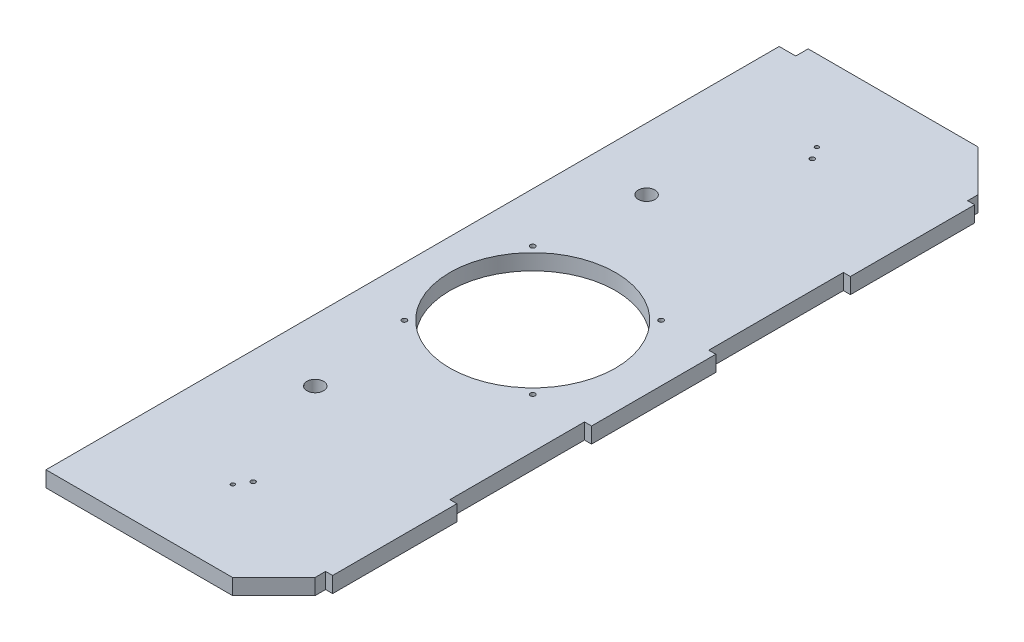
ISO-10303-21;
HEADER;
FILE_DESCRIPTION(('STEP AP214'),'2;1');
FILE_NAME('part.step','',(''),(''),'','','');
FILE_SCHEMA(('AUTOMOTIVE_DESIGN { 1 0 10303 214 1 1 1 1 }'));
ENDSEC;
DATA;
#1=APPLICATION_CONTEXT('core data for automotive mechanical design processes');
#2=APPLICATION_PROTOCOL_DEFINITION('international standard','automotive_design',2000,#1);
#3=PRODUCT_CONTEXT('',#1,'mechanical');
#4=PRODUCT('Part','Part','',(#3));
#5=PRODUCT_RELATED_PRODUCT_CATEGORY('part','',(#4));
#6=PRODUCT_DEFINITION_FORMATION('','',#4);
#7=PRODUCT_DEFINITION_CONTEXT('part definition',#1,'design');
#8=PRODUCT_DEFINITION('design','',#6,#7);
#9=PRODUCT_DEFINITION_SHAPE('','',#8);
#10=(LENGTH_UNIT() NAMED_UNIT(*) SI_UNIT(.MILLI.,.METRE.));
#11=(NAMED_UNIT(*) PLANE_ANGLE_UNIT() SI_UNIT($,.RADIAN.));
#12=(NAMED_UNIT(*) SI_UNIT($,.STERADIAN.) SOLID_ANGLE_UNIT());
#13=UNCERTAINTY_MEASURE_WITH_UNIT(LENGTH_MEASURE(1.E-05),#10,'distance_accuracy_value','');
#14=(GEOMETRIC_REPRESENTATION_CONTEXT(3) GLOBAL_UNCERTAINTY_ASSIGNED_CONTEXT((#13)) GLOBAL_UNIT_ASSIGNED_CONTEXT((#10,
#11,#12)) REPRESENTATION_CONTEXT('',''));
#15=CARTESIAN_POINT('',(0.,0.,0.));
#16=DIRECTION('',(0.,0.,1.));
#17=DIRECTION('',(1.,0.,0.));
#18=AXIS2_PLACEMENT_3D('',#15,#16,#17);
#19=CARTESIAN_POINT('',(0.,9.652,0.));
#20=DIRECTION('',(0.,-1.,0.));
#21=DIRECTION('',(0.,0.,-1.));
#22=AXIS2_PLACEMENT_3D('',#19,#20,#21);
#23=PLANE('',#22);
#24=CARTESIAN_POINT('',(65.024,9.652,-407.67));
#25=DIRECTION('',(0.,-1.,0.));
#26=DIRECTION('',(0.,0.,-1.));
#27=AXIS2_PLACEMENT_3D('',#24,#25,#26);
#28=CIRCLE('',#27,1.16786748412683);
#29=CARTESIAN_POINT('',(65.024,9.652,-408.837867484127));
#30=VERTEX_POINT('',#29);
#31=EDGE_CURVE('E446',#30,#30,#28,.T.);
#32=ORIENTED_EDGE('',*,*,#31,.T.);
#33=EDGE_LOOP('',(#32));
#34=FACE_BOUND('',#33,.T.);
#35=CARTESIAN_POINT('',(69.85,9.652,-400.05));
#36=DIRECTION('',(0.,-1.,0.));
#37=DIRECTION('',(0.,0.,-1.));
#38=AXIS2_PLACEMENT_3D('',#35,#36,#37);
#39=CIRCLE('',#38,1.41624735111162);
#40=CARTESIAN_POINT('',(69.85,9.652,-401.466247351112));
#41=VERTEX_POINT('',#40);
#42=EDGE_CURVE('E447',#41,#41,#39,.T.);
#43=ORIENTED_EDGE('',*,*,#42,.T.);
#44=EDGE_LOOP('',(#43));
#45=FACE_BOUND('',#44,.T.);
#46=CARTESIAN_POINT('',(65.024,9.652,-49.53));
#47=DIRECTION('',(0.,1.,0.));
#48=DIRECTION('',(0.,0.,1.));
#49=AXIS2_PLACEMENT_3D('',#46,#47,#48);
#50=CIRCLE('',#49,1.16786748412683);
#51=CARTESIAN_POINT('',(65.024,9.652,-48.3621325158732));
#52=VERTEX_POINT('',#51);
#53=EDGE_CURVE('E434',#52,#52,#50,.T.);
#54=ORIENTED_EDGE('',*,*,#53,.F.);
#55=EDGE_LOOP('',(#54));
#56=FACE_BOUND('',#55,.T.);
#57=CARTESIAN_POINT('',(69.85,9.652,-57.15));
#58=DIRECTION('',(0.,1.,0.));
#59=DIRECTION('',(0.,0.,1.));
#60=AXIS2_PLACEMENT_3D('',#57,#58,#59);
#61=CIRCLE('',#60,1.41624735111162);
#62=CARTESIAN_POINT('',(69.85,9.652,-55.7337526488884));
#63=VERTEX_POINT('',#62);
#64=EDGE_CURVE('E431',#63,#63,#61,.T.);
#65=ORIENTED_EDGE('',*,*,#64,.F.);
#66=EDGE_LOOP('',(#65));
#67=FACE_BOUND('',#66,.T.);
#68=DIRECTION('',(1.,0.,0.));
#69=VECTOR('',#68,1.);
#70=CARTESIAN_POINT('',(139.7,9.652,0.));
#71=LINE('',#70,#69);
#72=CARTESIAN_POINT('',(0.,9.652,0.));
#73=VERTEX_POINT('',#72);
#74=CARTESIAN_POINT('',(114.3,9.652,0.));
#75=VERTEX_POINT('',#74);
#76=EDGE_CURVE('E310',#73,#75,#71,.T.);
#77=ORIENTED_EDGE('',*,*,#76,.T.);
#78=DIRECTION('',(-0.707106781186549,0.,0.707106781186546));
#79=VECTOR('',#78,1.);
#80=CARTESIAN_POINT('',(139.7,9.652,-25.4));
#81=LINE('',#80,#79);
#82=CARTESIAN_POINT('',(139.7,9.652,-25.4));
#83=VERTEX_POINT('',#82);
#84=EDGE_CURVE('E48',#75,#83,#81,.F.);
#85=ORIENTED_EDGE('',*,*,#84,.T.);
#86=DIRECTION('',(0.,0.,-1.));
#87=VECTOR('',#86,1.);
#88=CARTESIAN_POINT('',(139.7,9.652,-457.2));
#89=LINE('',#88,#87);
#90=CARTESIAN_POINT('',(139.7,9.652,-31.75));
#91=VERTEX_POINT('',#90);
#92=EDGE_CURVE('E314',#83,#91,#89,.T.);
#93=ORIENTED_EDGE('',*,*,#92,.T.);
#94=DIRECTION('',(-1.,0.,0.));
#95=VECTOR('',#94,1.);
#96=CARTESIAN_POINT('',(144.018,9.652,-31.75));
#97=LINE('',#96,#95);
#98=CARTESIAN_POINT('',(144.018,9.652,-31.75));
#99=VERTEX_POINT('',#98);
#100=EDGE_CURVE('E257',#99,#91,#97,.T.);
#101=ORIENTED_EDGE('',*,*,#100,.F.);
#102=DIRECTION('',(0.,0.,1.));
#103=VECTOR('',#102,1.);
#104=CARTESIAN_POINT('',(144.018,9.652,-31.75));
#105=LINE('',#104,#103);
#106=CARTESIAN_POINT('',(144.018,9.652,-107.95));
#107=VERTEX_POINT('',#106);
#108=EDGE_CURVE('E255',#107,#99,#105,.T.);
#109=ORIENTED_EDGE('',*,*,#108,.F.);
#110=DIRECTION('',(-1.,0.,0.));
#111=VECTOR('',#110,1.);
#112=CARTESIAN_POINT('',(144.018,9.652,-107.95));
#113=LINE('',#112,#111);
#114=CARTESIAN_POINT('',(139.7,9.652,-107.95));
#115=VERTEX_POINT('',#114);
#116=EDGE_CURVE('E264',#107,#115,#113,.T.);
#117=ORIENTED_EDGE('',*,*,#116,.T.);
#118=CARTESIAN_POINT('',(139.7,9.652,-190.5));
#119=VERTEX_POINT('',#118);
#120=EDGE_CURVE('E318',#115,#119,#89,.T.);
#121=ORIENTED_EDGE('',*,*,#120,.T.);
#122=DIRECTION('',(-1.,0.,0.));
#123=VECTOR('',#122,1.);
#124=CARTESIAN_POINT('',(144.018,9.652,-190.5));
#125=LINE('',#124,#123);
#126=CARTESIAN_POINT('',(144.018,9.652,-190.5));
#127=VERTEX_POINT('',#126);
#128=EDGE_CURVE('E212',#127,#119,#125,.T.);
#129=ORIENTED_EDGE('',*,*,#128,.F.);
#130=DIRECTION('',(0.,0.,1.));
#131=VECTOR('',#130,1.);
#132=CARTESIAN_POINT('',(144.018,9.652,-190.5));
#133=LINE('',#132,#131);
#134=CARTESIAN_POINT('',(144.018,9.652,-266.7));
#135=VERTEX_POINT('',#134);
#136=EDGE_CURVE('E236',#135,#127,#133,.T.);
#137=ORIENTED_EDGE('',*,*,#136,.F.);
#138=DIRECTION('',(-1.,0.,0.));
#139=VECTOR('',#138,1.);
#140=CARTESIAN_POINT('',(144.018,9.652,-266.7));
#141=LINE('',#140,#139);
#142=CARTESIAN_POINT('',(139.7,9.652,-266.7));
#143=VERTEX_POINT('',#142);
#144=EDGE_CURVE('E228',#135,#143,#141,.T.);
#145=ORIENTED_EDGE('',*,*,#144,.T.);
#146=CARTESIAN_POINT('',(139.7,9.652,-349.25));
#147=VERTEX_POINT('',#146);
#148=EDGE_CURVE('E378',#143,#147,#89,.T.);
#149=ORIENTED_EDGE('',*,*,#148,.T.);
#150=DIRECTION('',(-1.,0.,0.));
#151=VECTOR('',#150,1.);
#152=CARTESIAN_POINT('',(144.018,9.652,-349.25));
#153=LINE('',#152,#151);
#154=CARTESIAN_POINT('',(144.018,9.652,-349.25));
#155=VERTEX_POINT('',#154);
#156=EDGE_CURVE('E207',#155,#147,#153,.T.);
#157=ORIENTED_EDGE('',*,*,#156,.F.);
#158=DIRECTION('',(0.,0.,1.));
#159=VECTOR('',#158,1.);
#160=CARTESIAN_POINT('',(144.018,9.652,-349.25));
#161=LINE('',#160,#159);
#162=CARTESIAN_POINT('',(144.018,9.652,-425.45));
#163=VERTEX_POINT('',#162);
#164=EDGE_CURVE('E198',#163,#155,#161,.T.);
#165=ORIENTED_EDGE('',*,*,#164,.F.);
#166=DIRECTION('',(-1.,0.,0.));
#167=VECTOR('',#166,1.);
#168=CARTESIAN_POINT('',(144.018,9.652,-425.45));
#169=LINE('',#168,#167);
#170=CARTESIAN_POINT('',(139.7,9.652,-425.45));
#171=VERTEX_POINT('',#170);
#172=EDGE_CURVE('E202',#163,#171,#169,.T.);
#173=ORIENTED_EDGE('',*,*,#172,.T.);
#174=CARTESIAN_POINT('',(139.7,9.652,-431.8));
#175=VERTEX_POINT('',#174);
#176=EDGE_CURVE('E55',#171,#175,#89,.T.);
#177=ORIENTED_EDGE('',*,*,#176,.T.);
#178=DIRECTION('',(0.707106781186546,0.,0.707106781186549));
#179=VECTOR('',#178,1.);
#180=CARTESIAN_POINT('',(114.3,9.652,-457.2));
#181=LINE('',#180,#179);
#182=CARTESIAN_POINT('',(114.3,9.652,-457.2));
#183=VERTEX_POINT('',#182);
#184=EDGE_CURVE('E341',#175,#183,#181,.F.);
#185=ORIENTED_EDGE('',*,*,#184,.T.);
#186=DIRECTION('',(-1.,0.,0.));
#187=VECTOR('',#186,1.);
#188=CARTESIAN_POINT('',(0.,9.652,-457.2));
#189=LINE('',#188,#187);
#190=CARTESIAN_POINT('',(10.16,9.652,-457.2));
#191=VERTEX_POINT('',#190);
#192=EDGE_CURVE('E317',#183,#191,#189,.T.);
#193=ORIENTED_EDGE('',*,*,#192,.T.);
#194=DIRECTION('',(0.,0.,-1.));
#195=VECTOR('',#194,1.);
#196=CARTESIAN_POINT('',(10.16,9.652,-457.2));
#197=LINE('',#196,#195);
#198=CARTESIAN_POINT('',(10.16,9.652,-449.58));
#199=VERTEX_POINT('',#198);
#200=EDGE_CURVE('E278',#199,#191,#197,.T.);
#201=ORIENTED_EDGE('',*,*,#200,.F.);
#202=DIRECTION('',(1.,0.,0.));
#203=VECTOR('',#202,1.);
#204=CARTESIAN_POINT('',(0.,9.652,-449.58));
#205=LINE('',#204,#203);
#206=CARTESIAN_POINT('',(0.,9.652,-449.58));
#207=VERTEX_POINT('',#206);
#208=EDGE_CURVE('E273',#207,#199,#205,.T.);
#209=ORIENTED_EDGE('',*,*,#208,.F.);
#210=DIRECTION('',(0.,0.,1.));
#211=VECTOR('',#210,1.);
#212=CARTESIAN_POINT('',(0.,9.652,0.));
#213=LINE('',#212,#211);
#214=EDGE_CURVE('E320',#207,#73,#213,.T.);
#215=ORIENTED_EDGE('',*,*,#214,.T.);
#216=EDGE_LOOP('',(#77,#85,#93,#101,#109,#117,#121,#129,#137,#145,#149,#157,#165,#173,#177,#185,
#193,#201,#209,#215));
#217=FACE_BOUND('',#216,.T.);
#218=CARTESIAN_POINT('',(69.85,9.652,-228.6));
#219=DIRECTION('',(0.,1.,0.));
#220=DIRECTION('',(0.,0.,1.));
#221=AXIS2_PLACEMENT_3D('',#218,#219,#220);
#222=CIRCLE('',#221,50.8);
#223=CARTESIAN_POINT('',(69.85,9.652,-177.8));
#224=VERTEX_POINT('',#223);
#225=EDGE_CURVE('E305',#224,#224,#222,.T.);
#226=ORIENTED_EDGE('',*,*,#225,.F.);
#227=EDGE_LOOP('',(#226));
#228=FACE_BOUND('',#227,.T.);
#229=CARTESIAN_POINT('',(38.1,9.652,-127.));
#230=DIRECTION('',(0.,1.,0.));
#231=DIRECTION('',(0.,0.,1.));
#232=AXIS2_PLACEMENT_3D('',#229,#230,#231);
#233=CIRCLE('',#232,5.08);
#234=CARTESIAN_POINT('',(38.1,9.652,-121.92));
#235=VERTEX_POINT('',#234);
#236=EDGE_CURVE('E299',#235,#235,#233,.T.);
#237=ORIENTED_EDGE('',*,*,#236,.F.);
#238=EDGE_LOOP('',(#237));
#239=FACE_BOUND('',#238,.T.);
#240=CARTESIAN_POINT('',(38.1,9.652,-330.2));
#241=DIRECTION('',(0.,1.,0.));
#242=DIRECTION('',(0.,0.,1.));
#243=AXIS2_PLACEMENT_3D('',#240,#241,#242);
#244=CIRCLE('',#243,5.08);
#245=CARTESIAN_POINT('',(38.1,9.652,-325.12));
#246=VERTEX_POINT('',#245);
#247=EDGE_CURVE('E293',#246,#246,#244,.T.);
#248=ORIENTED_EDGE('',*,*,#247,.F.);
#249=EDGE_LOOP('',(#248));
#250=FACE_BOUND('',#249,.T.);
#251=CARTESIAN_POINT('',(109.22,9.652,-267.97));
#252=DIRECTION('',(0.,1.,0.));
#253=DIRECTION('',(0.,0.,1.));
#254=AXIS2_PLACEMENT_3D('',#251,#252,#253);
#255=CIRCLE('',#254,1.5);
#256=CARTESIAN_POINT('',(109.22,9.652,-266.47));
#257=VERTEX_POINT('',#256);
#258=EDGE_CURVE('E407',#257,#257,#255,.T.);
#259=ORIENTED_EDGE('',*,*,#258,.F.);
#260=EDGE_LOOP('',(#259));
#261=FACE_BOUND('',#260,.T.);
#262=CARTESIAN_POINT('',(30.4800000000001,9.652,-267.97));
#263=DIRECTION('',(0.,1.,0.));
#264=DIRECTION('',(0.,0.,1.));
#265=AXIS2_PLACEMENT_3D('',#262,#263,#264);
#266=CIRCLE('',#265,1.5);
#267=CARTESIAN_POINT('',(30.4800000000001,9.652,-266.47));
#268=VERTEX_POINT('',#267);
#269=EDGE_CURVE('E415',#268,#268,#266,.T.);
#270=ORIENTED_EDGE('',*,*,#269,.F.);
#271=EDGE_LOOP('',(#270));
#272=FACE_BOUND('',#271,.T.);
#273=CARTESIAN_POINT('',(30.4800000000001,9.652,-189.23));
#274=DIRECTION('',(0.,1.,0.));
#275=DIRECTION('',(0.,0.,1.));
#276=AXIS2_PLACEMENT_3D('',#273,#274,#275);
#277=CIRCLE('',#276,1.5);
#278=CARTESIAN_POINT('',(30.4800000000001,9.652,-187.73));
#279=VERTEX_POINT('',#278);
#280=EDGE_CURVE('E421',#279,#279,#277,.T.);
#281=ORIENTED_EDGE('',*,*,#280,.F.);
#282=EDGE_LOOP('',(#281));
#283=FACE_BOUND('',#282,.T.);
#284=CARTESIAN_POINT('',(109.22,9.652,-189.23));
#285=DIRECTION('',(0.,1.,0.));
#286=DIRECTION('',(0.,0.,1.));
#287=AXIS2_PLACEMENT_3D('',#284,#285,#286);
#288=CIRCLE('',#287,1.5);
#289=CARTESIAN_POINT('',(109.22,9.652,-187.73));
#290=VERTEX_POINT('',#289);
#291=EDGE_CURVE('E427',#290,#290,#288,.T.);
#292=ORIENTED_EDGE('',*,*,#291,.F.);
#293=EDGE_LOOP('',(#292));
#294=FACE_BOUND('',#293,.T.);
#295=ADVANCED_FACE('F39',(#34,#45,#56,#67,#217,#228,#239,#250,#261,#272,#283,#294),#23,.F.);
#296=CARTESIAN_POINT('',(139.7,9.652,-457.2));
#297=DIRECTION('',(-1.,0.,0.));
#298=DIRECTION('',(0.,0.,1.));
#299=AXIS2_PLACEMENT_3D('',#296,#297,#298);
#300=PLANE('',#299);
#301=DIRECTION('',(0.,-1.,0.));
#302=VECTOR('',#301,1.);
#303=CARTESIAN_POINT('',(139.7,9.652,-349.25));
#304=LINE('',#303,#302);
#305=CARTESIAN_POINT('',(139.7,0.,-349.25));
#306=VERTEX_POINT('',#305);
#307=EDGE_CURVE('E63',#147,#306,#304,.T.);
#308=ORIENTED_EDGE('',*,*,#307,.F.);
#309=ORIENTED_EDGE('',*,*,#148,.F.);
#310=DIRECTION('',(0.,1.,0.));
#311=VECTOR('',#310,1.);
#312=CARTESIAN_POINT('',(139.7,9.652,-266.7));
#313=LINE('',#312,#311);
#314=CARTESIAN_POINT('',(139.7,0.,-266.7));
#315=VERTEX_POINT('',#314);
#316=EDGE_CURVE('E232',#315,#143,#313,.T.);
#317=ORIENTED_EDGE('',*,*,#316,.F.);
#318=DIRECTION('',(0.,0.,-1.));
#319=VECTOR('',#318,1.);
#320=CARTESIAN_POINT('',(139.7,0.,-457.2));
#321=LINE('',#320,#319);
#322=EDGE_CURVE('E189',#315,#306,#321,.T.);
#323=ORIENTED_EDGE('',*,*,#322,.T.);
#324=EDGE_LOOP('',(#308,#309,#317,#323));
#325=FACE_BOUND('',#324,.T.);
#326=ADVANCED_FACE('F399',(#325),#300,.F.);
#327=DIRECTION('',(0.,1.,0.));
#328=VECTOR('',#327,1.);
#329=CARTESIAN_POINT('',(139.7,9.652,-425.45));
#330=LINE('',#329,#328);
#331=CARTESIAN_POINT('',(139.7,0.,-425.45));
#332=VERTEX_POINT('',#331);
#333=EDGE_CURVE('E193',#332,#171,#330,.T.);
#334=ORIENTED_EDGE('',*,*,#333,.F.);
#335=CARTESIAN_POINT('',(139.7,0.,-431.8));
#336=VERTEX_POINT('',#335);
#337=EDGE_CURVE('E178',#332,#336,#321,.T.);
#338=ORIENTED_EDGE('',*,*,#337,.T.);
#339=DIRECTION('',(0.,1.,0.));
#340=VECTOR('',#339,1.);
#341=CARTESIAN_POINT('',(139.7,9.652,-431.8));
#342=LINE('',#341,#340);
#343=EDGE_CURVE('E331',#336,#175,#342,.T.);
#344=ORIENTED_EDGE('',*,*,#343,.T.);
#345=ORIENTED_EDGE('',*,*,#176,.F.);
#346=EDGE_LOOP('',(#334,#338,#344,#345));
#347=FACE_BOUND('',#346,.T.);
#348=ADVANCED_FACE('F194',(#347),#300,.F.);
#349=DIRECTION('',(0.,-1.,0.));
#350=VECTOR('',#349,1.);
#351=CARTESIAN_POINT('',(139.7,9.652,-190.5));
#352=LINE('',#351,#350);
#353=CARTESIAN_POINT('',(139.7,0.,-190.5));
#354=VERTEX_POINT('',#353);
#355=EDGE_CURVE('E235',#119,#354,#352,.T.);
#356=ORIENTED_EDGE('',*,*,#355,.F.);
#357=ORIENTED_EDGE('',*,*,#120,.F.);
#358=DIRECTION('',(0.,1.,0.));
#359=VECTOR('',#358,1.);
#360=CARTESIAN_POINT('',(139.7,9.652,-107.95));
#361=LINE('',#360,#359);
#362=CARTESIAN_POINT('',(139.7,0.,-107.95));
#363=VERTEX_POINT('',#362);
#364=EDGE_CURVE('E251',#363,#115,#361,.T.);
#365=ORIENTED_EDGE('',*,*,#364,.F.);
#366=EDGE_CURVE('E326',#363,#354,#321,.T.);
#367=ORIENTED_EDGE('',*,*,#366,.T.);
#368=EDGE_LOOP('',(#356,#357,#365,#367));
#369=FACE_BOUND('',#368,.T.);
#370=ADVANCED_FACE('F510',(#369),#300,.F.);
#371=DIRECTION('',(0.,-1.,0.));
#372=VECTOR('',#371,1.);
#373=CARTESIAN_POINT('',(139.7,9.652,-31.75));
#374=LINE('',#373,#372);
#375=CARTESIAN_POINT('',(139.7,0.,-31.75));
#376=VERTEX_POINT('',#375);
#377=EDGE_CURVE('E239',#91,#376,#374,.T.);
#378=ORIENTED_EDGE('',*,*,#377,.F.);
#379=ORIENTED_EDGE('',*,*,#92,.F.);
#380=DIRECTION('',(0.,-1.,0.));
#381=VECTOR('',#380,1.);
#382=CARTESIAN_POINT('',(139.7,9.652,-25.4));
#383=LINE('',#382,#381);
#384=CARTESIAN_POINT('',(139.7,0.,-25.4));
#385=VERTEX_POINT('',#384);
#386=EDGE_CURVE('E333',#83,#385,#383,.T.);
#387=ORIENTED_EDGE('',*,*,#386,.T.);
#388=EDGE_CURVE('E192',#385,#376,#321,.T.);
#389=ORIENTED_EDGE('',*,*,#388,.T.);
#390=EDGE_LOOP('',(#378,#379,#387,#389));
#391=FACE_BOUND('',#390,.T.);
#392=ADVANCED_FACE('F352',(#391),#300,.F.);
#393=CARTESIAN_POINT('',(0.,0.,0.));
#394=DIRECTION('',(0.,-1.,0.));
#395=DIRECTION('',(0.,0.,-1.));
#396=AXIS2_PLACEMENT_3D('',#393,#394,#395);
#397=PLANE('',#396);
#398=CARTESIAN_POINT('',(65.024,0.,-407.67));
#399=DIRECTION('',(0.,-1.,0.));
#400=DIRECTION('',(0.,0.,-1.));
#401=AXIS2_PLACEMENT_3D('',#398,#399,#400);
#402=CIRCLE('',#401,1.16786748412683);
#403=CARTESIAN_POINT('',(65.024,0.,-408.837867484127));
#404=VERTEX_POINT('',#403);
#405=EDGE_CURVE('E438',#404,#404,#402,.T.);
#406=ORIENTED_EDGE('',*,*,#405,.F.);
#407=EDGE_LOOP('',(#406));
#408=FACE_BOUND('',#407,.T.);
#409=CARTESIAN_POINT('',(69.85,0.,-400.05));
#410=DIRECTION('',(0.,-1.,0.));
#411=DIRECTION('',(0.,0.,-1.));
#412=AXIS2_PLACEMENT_3D('',#409,#410,#411);
#413=CIRCLE('',#412,1.41624735111162);
#414=CARTESIAN_POINT('',(69.85,0.,-401.466247351112));
#415=VERTEX_POINT('',#414);
#416=EDGE_CURVE('E443',#415,#415,#413,.T.);
#417=ORIENTED_EDGE('',*,*,#416,.F.);
#418=EDGE_LOOP('',(#417));
#419=FACE_BOUND('',#418,.T.);
#420=CARTESIAN_POINT('',(65.024,0.,-49.53));
#421=DIRECTION('',(0.,-1.,0.));
#422=DIRECTION('',(0.,0.,-1.));
#423=AXIS2_PLACEMENT_3D('',#420,#421,#422);
#424=CIRCLE('',#423,1.16786748412683);
#425=CARTESIAN_POINT('',(65.024,0.,-50.6978674841269));
#426=VERTEX_POINT('',#425);
#427=EDGE_CURVE('E430',#426,#426,#424,.F.);
#428=ORIENTED_EDGE('',*,*,#427,.T.);
#429=EDGE_LOOP('',(#428));
#430=FACE_BOUND('',#429,.T.);
#431=CARTESIAN_POINT('',(69.85,0.,-57.15));
#432=DIRECTION('',(0.,-1.,0.));
#433=DIRECTION('',(0.,0.,-1.));
#434=AXIS2_PLACEMENT_3D('',#431,#432,#433);
#435=CIRCLE('',#434,1.41624735111162);
#436=CARTESIAN_POINT('',(69.85,0.,-58.5662473511116));
#437=VERTEX_POINT('',#436);
#438=EDGE_CURVE('E435',#437,#437,#435,.F.);
#439=ORIENTED_EDGE('',*,*,#438,.T.);
#440=EDGE_LOOP('',(#439));
#441=FACE_BOUND('',#440,.T.);
#442=CARTESIAN_POINT('',(109.22,0.,-189.23));
#443=DIRECTION('',(0.,-1.,0.));
#444=DIRECTION('',(0.,0.,-1.));
#445=AXIS2_PLACEMENT_3D('',#442,#443,#444);
#446=CIRCLE('',#445,1.5);
#447=CARTESIAN_POINT('',(109.22,0.,-190.73));
#448=VERTEX_POINT('',#447);
#449=EDGE_CURVE('E424',#448,#448,#446,.T.);
#450=ORIENTED_EDGE('',*,*,#449,.F.);
#451=EDGE_LOOP('',(#450));
#452=FACE_BOUND('',#451,.T.);
#453=CARTESIAN_POINT('',(30.4800000000001,0.,-189.23));
#454=DIRECTION('',(0.,-1.,0.));
#455=DIRECTION('',(0.,0.,-1.));
#456=AXIS2_PLACEMENT_3D('',#453,#454,#455);
#457=CIRCLE('',#456,1.5);
#458=CARTESIAN_POINT('',(30.4800000000001,0.,-190.73));
#459=VERTEX_POINT('',#458);
#460=EDGE_CURVE('E418',#459,#459,#457,.T.);
#461=ORIENTED_EDGE('',*,*,#460,.F.);
#462=EDGE_LOOP('',(#461));
#463=FACE_BOUND('',#462,.T.);
#464=CARTESIAN_POINT('',(30.4800000000001,0.,-267.97));
#465=DIRECTION('',(0.,-1.,0.));
#466=DIRECTION('',(0.,0.,-1.));
#467=AXIS2_PLACEMENT_3D('',#464,#465,#466);
#468=CIRCLE('',#467,1.5);
#469=CARTESIAN_POINT('',(30.4800000000001,0.,-269.47));
#470=VERTEX_POINT('',#469);
#471=EDGE_CURVE('E412',#470,#470,#468,.T.);
#472=ORIENTED_EDGE('',*,*,#471,.F.);
#473=EDGE_LOOP('',(#472));
#474=FACE_BOUND('',#473,.T.);
#475=CARTESIAN_POINT('',(109.22,0.,-267.97));
#476=DIRECTION('',(0.,-1.,0.));
#477=DIRECTION('',(0.,0.,-1.));
#478=AXIS2_PLACEMENT_3D('',#475,#476,#477);
#479=CIRCLE('',#478,1.5);
#480=CARTESIAN_POINT('',(109.22,0.,-269.47));
#481=VERTEX_POINT('',#480);
#482=EDGE_CURVE('E405',#481,#481,#479,.T.);
#483=ORIENTED_EDGE('',*,*,#482,.F.);
#484=EDGE_LOOP('',(#483));
#485=FACE_BOUND('',#484,.T.);
#486=ORIENTED_EDGE('',*,*,#388,.F.);
#487=DIRECTION('',(0.707106781186549,0.,-0.707106781186546));
#488=VECTOR('',#487,1.);
#489=CARTESIAN_POINT('',(57.1499999999997,0.,57.15));
#490=LINE('',#489,#488);
#491=CARTESIAN_POINT('',(114.3,0.,0.));
#492=VERTEX_POINT('',#491);
#493=EDGE_CURVE('E337',#385,#492,#490,.F.);
#494=ORIENTED_EDGE('',*,*,#493,.T.);
#495=DIRECTION('',(1.,0.,0.));
#496=VECTOR('',#495,1.);
#497=CARTESIAN_POINT('',(139.7,0.,0.));
#498=LINE('',#497,#496);
#499=CARTESIAN_POINT('',(0.,0.,0.));
#500=VERTEX_POINT('',#499);
#501=EDGE_CURVE('E190',#500,#492,#498,.T.);
#502=ORIENTED_EDGE('',*,*,#501,.F.);
#503=DIRECTION('',(0.,0.,1.));
#504=VECTOR('',#503,1.);
#505=CARTESIAN_POINT('',(0.,0.,0.));
#506=LINE('',#505,#504);
#507=CARTESIAN_POINT('',(0.,0.,-449.58));
#508=VERTEX_POINT('',#507);
#509=EDGE_CURVE('E313',#508,#500,#506,.T.);
#510=ORIENTED_EDGE('',*,*,#509,.F.);
#511=DIRECTION('',(1.,0.,0.));
#512=VECTOR('',#511,1.);
#513=CARTESIAN_POINT('',(0.,0.,-449.58));
#514=LINE('',#513,#512);
#515=CARTESIAN_POINT('',(10.16,0.,-449.58));
#516=VERTEX_POINT('',#515);
#517=EDGE_CURVE('E274',#508,#516,#514,.T.);
#518=ORIENTED_EDGE('',*,*,#517,.T.);
#519=DIRECTION('',(0.,0.,-1.));
#520=VECTOR('',#519,1.);
#521=CARTESIAN_POINT('',(10.16,0.,-457.2));
#522=LINE('',#521,#520);
#523=CARTESIAN_POINT('',(10.16,0.,-457.2));
#524=VERTEX_POINT('',#523);
#525=EDGE_CURVE('E277',#516,#524,#522,.T.);
#526=ORIENTED_EDGE('',*,*,#525,.T.);
#527=DIRECTION('',(-1.,0.,0.));
#528=VECTOR('',#527,1.);
#529=CARTESIAN_POINT('',(0.,0.,-457.2));
#530=LINE('',#529,#528);
#531=CARTESIAN_POINT('',(114.3,0.,-457.2));
#532=VERTEX_POINT('',#531);
#533=EDGE_CURVE('E325',#532,#524,#530,.T.);
#534=ORIENTED_EDGE('',*,*,#533,.F.);
#535=DIRECTION('',(-0.707106781186546,0.,-0.707106781186549));
#536=VECTOR('',#535,1.);
#537=CARTESIAN_POINT('',(285.75,0.,-285.749999999999));
#538=LINE('',#537,#536);
#539=EDGE_CURVE('E187',#532,#336,#538,.F.);
#540=ORIENTED_EDGE('',*,*,#539,.T.);
#541=ORIENTED_EDGE('',*,*,#337,.F.);
#542=DIRECTION('',(-1.,0.,0.));
#543=VECTOR('',#542,1.);
#544=CARTESIAN_POINT('',(144.018,0.,-425.45));
#545=LINE('',#544,#543);
#546=CARTESIAN_POINT('',(144.018,0.,-425.45));
#547=VERTEX_POINT('',#546);
#548=EDGE_CURVE('E184',#547,#332,#545,.T.);
#549=ORIENTED_EDGE('',*,*,#548,.F.);
#550=DIRECTION('',(0.,0.,-1.));
#551=VECTOR('',#550,1.);
#552=CARTESIAN_POINT('',(144.018,0.,-349.25));
#553=LINE('',#552,#551);
#554=CARTESIAN_POINT('',(144.018,0.,-349.25));
#555=VERTEX_POINT('',#554);
#556=EDGE_CURVE('E214',#555,#547,#553,.T.);
#557=ORIENTED_EDGE('',*,*,#556,.F.);
#558=DIRECTION('',(-1.,0.,0.));
#559=VECTOR('',#558,1.);
#560=CARTESIAN_POINT('',(144.018,0.,-349.25));
#561=LINE('',#560,#559);
#562=EDGE_CURVE('E203',#555,#306,#561,.T.);
#563=ORIENTED_EDGE('',*,*,#562,.T.);
#564=ORIENTED_EDGE('',*,*,#322,.F.);
#565=DIRECTION('',(-1.,0.,0.));
#566=VECTOR('',#565,1.);
#567=CARTESIAN_POINT('',(144.018,0.,-266.7));
#568=LINE('',#567,#566);
#569=CARTESIAN_POINT('',(144.018,0.,-266.7));
#570=VERTEX_POINT('',#569);
#571=EDGE_CURVE('E225',#570,#315,#568,.T.);
#572=ORIENTED_EDGE('',*,*,#571,.F.);
#573=DIRECTION('',(0.,0.,-1.));
#574=VECTOR('',#573,1.);
#575=CARTESIAN_POINT('',(144.018,0.,-190.5));
#576=LINE('',#575,#574);
#577=CARTESIAN_POINT('',(144.018,0.,-190.5));
#578=VERTEX_POINT('',#577);
#579=EDGE_CURVE('E241',#578,#570,#576,.T.);
#580=ORIENTED_EDGE('',*,*,#579,.F.);
#581=DIRECTION('',(-1.,0.,0.));
#582=VECTOR('',#581,1.);
#583=CARTESIAN_POINT('',(144.018,0.,-190.5));
#584=LINE('',#583,#582);
#585=EDGE_CURVE('E222',#578,#354,#584,.T.);
#586=ORIENTED_EDGE('',*,*,#585,.T.);
#587=ORIENTED_EDGE('',*,*,#366,.F.);
#588=DIRECTION('',(-1.,0.,0.));
#589=VECTOR('',#588,1.);
#590=CARTESIAN_POINT('',(144.018,0.,-107.95));
#591=LINE('',#590,#589);
#592=CARTESIAN_POINT('',(144.018,0.,-107.95));
#593=VERTEX_POINT('',#592);
#594=EDGE_CURVE('E267',#593,#363,#591,.T.);
#595=ORIENTED_EDGE('',*,*,#594,.F.);
#596=DIRECTION('',(0.,0.,-1.));
#597=VECTOR('',#596,1.);
#598=CARTESIAN_POINT('',(144.018,0.,-31.75));
#599=LINE('',#598,#597);
#600=CARTESIAN_POINT('',(144.018,0.,-31.75));
#601=VERTEX_POINT('',#600);
#602=EDGE_CURVE('E250',#601,#593,#599,.T.);
#603=ORIENTED_EDGE('',*,*,#602,.F.);
#604=DIRECTION('',(-1.,0.,0.));
#605=VECTOR('',#604,1.);
#606=CARTESIAN_POINT('',(144.018,0.,-31.75));
#607=LINE('',#606,#605);
#608=EDGE_CURVE('E270',#601,#376,#607,.T.);
#609=ORIENTED_EDGE('',*,*,#608,.T.);
#610=EDGE_LOOP('',(#486,#494,#502,#510,#518,#526,#534,#540,#541,#549,#557,#563,#564,#572,#580,
#586,#587,#595,#603,#609));
#611=FACE_BOUND('',#610,.T.);
#612=CARTESIAN_POINT('',(38.1,0.,-127.));
#613=DIRECTION('',(0.,1.,0.));
#614=DIRECTION('',(0.,0.,1.));
#615=AXIS2_PLACEMENT_3D('',#612,#613,#614);
#616=CIRCLE('',#615,5.08);
#617=CARTESIAN_POINT('',(38.1,0.,-121.92));
#618=VERTEX_POINT('',#617);
#619=EDGE_CURVE('E296',#618,#618,#616,.T.);
#620=ORIENTED_EDGE('',*,*,#619,.T.);
#621=EDGE_LOOP('',(#620));
#622=FACE_BOUND('',#621,.T.);
#623=CARTESIAN_POINT('',(69.85,0.,-228.6));
#624=DIRECTION('',(0.,1.,0.));
#625=DIRECTION('',(0.,0.,1.));
#626=AXIS2_PLACEMENT_3D('',#623,#624,#625);
#627=CIRCLE('',#626,50.8);
#628=CARTESIAN_POINT('',(69.85,0.,-177.8));
#629=VERTEX_POINT('',#628);
#630=EDGE_CURVE('E302',#629,#629,#627,.T.);
#631=ORIENTED_EDGE('',*,*,#630,.T.);
#632=EDGE_LOOP('',(#631));
#633=FACE_BOUND('',#632,.T.);
#634=CARTESIAN_POINT('',(38.1,0.,-330.2));
#635=DIRECTION('',(0.,1.,0.));
#636=DIRECTION('',(0.,0.,1.));
#637=AXIS2_PLACEMENT_3D('',#634,#635,#636);
#638=CIRCLE('',#637,5.08);
#639=CARTESIAN_POINT('',(38.1,0.,-325.12));
#640=VERTEX_POINT('',#639);
#641=EDGE_CURVE('E289',#640,#640,#638,.T.);
#642=ORIENTED_EDGE('',*,*,#641,.T.);
#643=EDGE_LOOP('',(#642));
#644=FACE_BOUND('',#643,.T.);
#645=ADVANCED_FACE('F180',(#408,#419,#430,#441,#452,#463,#474,#485,#611,#622,#633,#644),#397,.T.);
#646=CARTESIAN_POINT('',(139.7,9.652,0.));
#647=DIRECTION('',(0.,0.,-1.));
#648=DIRECTION('',(-1.,0.,0.));
#649=AXIS2_PLACEMENT_3D('',#646,#647,#648);
#650=PLANE('',#649);
#651=ORIENTED_EDGE('',*,*,#501,.T.);
#652=DIRECTION('',(0.,1.,0.));
#653=VECTOR('',#652,1.);
#654=CARTESIAN_POINT('',(114.3,9.652,0.));
#655=LINE('',#654,#653);
#656=EDGE_CURVE('E339',#492,#75,#655,.T.);
#657=ORIENTED_EDGE('',*,*,#656,.T.);
#658=ORIENTED_EDGE('',*,*,#76,.F.);
#659=DIRECTION('',(0.,-1.,0.));
#660=VECTOR('',#659,1.);
#661=CARTESIAN_POINT('',(0.,9.652,0.));
#662=LINE('',#661,#660);
#663=EDGE_CURVE('E322',#73,#500,#662,.T.);
#664=ORIENTED_EDGE('',*,*,#663,.T.);
#665=EDGE_LOOP('',(#651,#657,#658,#664));
#666=FACE_BOUND('',#665,.T.);
#667=ADVANCED_FACE('F357',(#666),#650,.F.);
#668=CARTESIAN_POINT('',(0.,9.652,-457.2));
#669=DIRECTION('',(0.,0.,1.));
#670=DIRECTION('',(1.,0.,0.));
#671=AXIS2_PLACEMENT_3D('',#668,#669,#670);
#672=PLANE('',#671);
#673=ORIENTED_EDGE('',*,*,#192,.F.);
#674=DIRECTION('',(0.,-1.,0.));
#675=VECTOR('',#674,1.);
#676=CARTESIAN_POINT('',(114.3,9.652,-457.2));
#677=LINE('',#676,#675);
#678=EDGE_CURVE('E11',#183,#532,#677,.T.);
#679=ORIENTED_EDGE('',*,*,#678,.T.);
#680=ORIENTED_EDGE('',*,*,#533,.T.);
#681=DIRECTION('',(0.,1.,0.));
#682=VECTOR('',#681,1.);
#683=CARTESIAN_POINT('',(10.16,0.,-457.2));
#684=LINE('',#683,#682);
#685=EDGE_CURVE('E286',#524,#191,#684,.T.);
#686=ORIENTED_EDGE('',*,*,#685,.T.);
#687=EDGE_LOOP('',(#673,#679,#680,#686));
#688=FACE_BOUND('',#687,.T.);
#689=ADVANCED_FACE('F373',(#688),#672,.F.);
#690=CARTESIAN_POINT('',(0.,9.652,0.));
#691=DIRECTION('',(1.,0.,0.));
#692=DIRECTION('',(0.,0.,-1.));
#693=AXIS2_PLACEMENT_3D('',#690,#691,#692);
#694=PLANE('',#693);
#695=ORIENTED_EDGE('',*,*,#214,.F.);
#696=DIRECTION('',(0.,1.,0.));
#697=VECTOR('',#696,1.);
#698=CARTESIAN_POINT('',(0.,0.,-449.58));
#699=LINE('',#698,#697);
#700=EDGE_CURVE('E281',#508,#207,#699,.T.);
#701=ORIENTED_EDGE('',*,*,#700,.F.);
#702=ORIENTED_EDGE('',*,*,#509,.T.);
#703=ORIENTED_EDGE('',*,*,#663,.F.);
#704=EDGE_LOOP('',(#695,#701,#702,#703));
#705=FACE_BOUND('',#704,.T.);
#706=ADVANCED_FACE('F361',(#705),#694,.F.);
#707=CARTESIAN_POINT('',(69.85,9.652,-228.6));
#708=DIRECTION('',(0.,-1.,0.));
#709=DIRECTION('',(0.,0.,-1.));
#710=AXIS2_PLACEMENT_3D('',#707,#708,#709);
#711=CYLINDRICAL_SURFACE('',#710,50.8);
#712=ORIENTED_EDGE('',*,*,#225,.T.);
#713=EDGE_LOOP('',(#712));
#714=FACE_BOUND('',#713,.T.);
#715=ORIENTED_EDGE('',*,*,#630,.F.);
#716=EDGE_LOOP('',(#715));
#717=FACE_BOUND('',#716,.T.);
#718=ADVANCED_FACE('F502',(#714,#717),#711,.F.);
#719=CARTESIAN_POINT('',(38.1,9.652,-127.));
#720=DIRECTION('',(0.,-1.,0.));
#721=DIRECTION('',(0.,0.,-1.));
#722=AXIS2_PLACEMENT_3D('',#719,#720,#721);
#723=CYLINDRICAL_SURFACE('',#722,5.08);
#724=ORIENTED_EDGE('',*,*,#236,.T.);
#725=EDGE_LOOP('',(#724));
#726=FACE_BOUND('',#725,.T.);
#727=ORIENTED_EDGE('',*,*,#619,.F.);
#728=EDGE_LOOP('',(#727));
#729=FACE_BOUND('',#728,.T.);
#730=ADVANCED_FACE('F530',(#726,#729),#723,.F.);
#731=CARTESIAN_POINT('',(38.1,9.652,-330.2));
#732=DIRECTION('',(0.,-1.,0.));
#733=DIRECTION('',(0.,0.,-1.));
#734=AXIS2_PLACEMENT_3D('',#731,#732,#733);
#735=CYLINDRICAL_SURFACE('',#734,5.08);
#736=ORIENTED_EDGE('',*,*,#247,.T.);
#737=EDGE_LOOP('',(#736));
#738=FACE_BOUND('',#737,.T.);
#739=ORIENTED_EDGE('',*,*,#641,.F.);
#740=EDGE_LOOP('',(#739));
#741=FACE_BOUND('',#740,.T.);
#742=ADVANCED_FACE('F525',(#738,#741),#735,.F.);
#743=CARTESIAN_POINT('',(10.16,0.,-457.2));
#744=DIRECTION('',(1.,0.,0.));
#745=DIRECTION('',(0.,0.,-1.));
#746=AXIS2_PLACEMENT_3D('',#743,#744,#745);
#747=PLANE('',#746);
#748=ORIENTED_EDGE('',*,*,#200,.T.);
#749=ORIENTED_EDGE('',*,*,#685,.F.);
#750=ORIENTED_EDGE('',*,*,#525,.F.);
#751=DIRECTION('',(0.,1.,0.));
#752=VECTOR('',#751,1.);
#753=CARTESIAN_POINT('',(10.16,0.,-449.58));
#754=LINE('',#753,#752);
#755=EDGE_CURVE('E290',#516,#199,#754,.T.);
#756=ORIENTED_EDGE('',*,*,#755,.T.);
#757=EDGE_LOOP('',(#748,#749,#750,#756));
#758=FACE_BOUND('',#757,.T.);
#759=ADVANCED_FACE('F370',(#758),#747,.F.);
#760=CARTESIAN_POINT('',(0.,0.,-449.58));
#761=DIRECTION('',(0.,0.,1.));
#762=DIRECTION('',(1.,0.,0.));
#763=AXIS2_PLACEMENT_3D('',#760,#761,#762);
#764=PLANE('',#763);
#765=ORIENTED_EDGE('',*,*,#208,.T.);
#766=ORIENTED_EDGE('',*,*,#755,.F.);
#767=ORIENTED_EDGE('',*,*,#517,.F.);
#768=ORIENTED_EDGE('',*,*,#700,.T.);
#769=EDGE_LOOP('',(#765,#766,#767,#768));
#770=FACE_BOUND('',#769,.T.);
#771=ADVANCED_FACE('F365',(#770),#764,.F.);
#772=CARTESIAN_POINT('',(139.7,9.652,-25.4));
#773=DIRECTION('',(-0.707106781186546,0.,-0.707106781186549));
#774=DIRECTION('',(0.,-1.,0.));
#775=AXIS2_PLACEMENT_3D('',#772,#773,#774);
#776=PLANE('',#775);
#777=ORIENTED_EDGE('',*,*,#84,.F.);
#778=ORIENTED_EDGE('',*,*,#656,.F.);
#779=ORIENTED_EDGE('',*,*,#493,.F.);
#780=ORIENTED_EDGE('',*,*,#386,.F.);
#781=EDGE_LOOP('',(#777,#778,#779,#780));
#782=FACE_BOUND('',#781,.T.);
#783=ADVANCED_FACE('F353',(#782),#776,.F.);
#784=CARTESIAN_POINT('',(114.3,9.652,-457.2));
#785=DIRECTION('',(-0.707106781186549,0.,0.707106781186546));
#786=DIRECTION('',(0.,-1.,0.));
#787=AXIS2_PLACEMENT_3D('',#784,#785,#786);
#788=PLANE('',#787);
#789=ORIENTED_EDGE('',*,*,#184,.F.);
#790=ORIENTED_EDGE('',*,*,#343,.F.);
#791=ORIENTED_EDGE('',*,*,#539,.F.);
#792=ORIENTED_EDGE('',*,*,#678,.F.);
#793=EDGE_LOOP('',(#789,#790,#791,#792));
#794=FACE_BOUND('',#793,.T.);
#795=ADVANCED_FACE('F42',(#794),#788,.F.);
#796=CARTESIAN_POINT('',(144.018,9.652,-31.75));
#797=DIRECTION('',(0.,0.,-1.));
#798=DIRECTION('',(-1.,0.,0.));
#799=AXIS2_PLACEMENT_3D('',#796,#797,#798);
#800=PLANE('',#799);
#801=ORIENTED_EDGE('',*,*,#377,.T.);
#802=ORIENTED_EDGE('',*,*,#608,.F.);
#803=DIRECTION('',(0.,-1.,0.));
#804=VECTOR('',#803,1.);
#805=CARTESIAN_POINT('',(144.018,9.652,-31.75));
#806=LINE('',#805,#804);
#807=EDGE_CURVE('E247',#99,#601,#806,.T.);
#808=ORIENTED_EDGE('',*,*,#807,.F.);
#809=ORIENTED_EDGE('',*,*,#100,.T.);
#810=EDGE_LOOP('',(#801,#802,#808,#809));
#811=FACE_BOUND('',#810,.T.);
#812=ADVANCED_FACE('F520',(#811),#800,.F.);
#813=CARTESIAN_POINT('',(144.018,9.652,-107.95));
#814=DIRECTION('',(0.,0.,1.));
#815=DIRECTION('',(1.,0.,0.));
#816=AXIS2_PLACEMENT_3D('',#813,#814,#815);
#817=PLANE('',#816);
#818=ORIENTED_EDGE('',*,*,#364,.T.);
#819=ORIENTED_EDGE('',*,*,#116,.F.);
#820=DIRECTION('',(0.,1.,0.));
#821=VECTOR('',#820,1.);
#822=CARTESIAN_POINT('',(144.018,9.652,-107.95));
#823=LINE('',#822,#821);
#824=EDGE_CURVE('E253',#593,#107,#823,.T.);
#825=ORIENTED_EDGE('',*,*,#824,.F.);
#826=ORIENTED_EDGE('',*,*,#594,.T.);
#827=EDGE_LOOP('',(#818,#819,#825,#826));
#828=FACE_BOUND('',#827,.T.);
#829=ADVANCED_FACE('F778',(#828),#817,.F.);
#830=CARTESIAN_POINT('',(144.018,0.,0.));
#831=DIRECTION('',(1.,0.,0.));
#832=DIRECTION('',(0.,0.,-1.));
#833=AXIS2_PLACEMENT_3D('',#830,#831,#832);
#834=PLANE('',#833);
#835=ORIENTED_EDGE('',*,*,#807,.T.);
#836=ORIENTED_EDGE('',*,*,#602,.T.);
#837=ORIENTED_EDGE('',*,*,#824,.T.);
#838=ORIENTED_EDGE('',*,*,#108,.T.);
#839=EDGE_LOOP('',(#835,#836,#837,#838));
#840=FACE_BOUND('',#839,.T.);
#841=ADVANCED_FACE('F787',(#840),#834,.T.);
#842=CARTESIAN_POINT('',(144.018,9.652,-190.5));
#843=DIRECTION('',(0.,0.,-1.));
#844=DIRECTION('',(-1.,0.,0.));
#845=AXIS2_PLACEMENT_3D('',#842,#843,#844);
#846=PLANE('',#845);
#847=ORIENTED_EDGE('',*,*,#355,.T.);
#848=ORIENTED_EDGE('',*,*,#585,.F.);
#849=DIRECTION('',(0.,-1.,0.));
#850=VECTOR('',#849,1.);
#851=CARTESIAN_POINT('',(144.018,9.652,-190.5));
#852=LINE('',#851,#850);
#853=EDGE_CURVE('E243',#127,#578,#852,.T.);
#854=ORIENTED_EDGE('',*,*,#853,.F.);
#855=ORIENTED_EDGE('',*,*,#128,.T.);
#856=EDGE_LOOP('',(#847,#848,#854,#855));
#857=FACE_BOUND('',#856,.T.);
#858=ADVANCED_FACE('F388',(#857),#846,.F.);
#859=CARTESIAN_POINT('',(144.018,9.652,-266.7));
#860=DIRECTION('',(0.,0.,1.));
#861=DIRECTION('',(1.,0.,0.));
#862=AXIS2_PLACEMENT_3D('',#859,#860,#861);
#863=PLANE('',#862);
#864=ORIENTED_EDGE('',*,*,#316,.T.);
#865=ORIENTED_EDGE('',*,*,#144,.F.);
#866=DIRECTION('',(0.,1.,0.));
#867=VECTOR('',#866,1.);
#868=CARTESIAN_POINT('',(144.018,9.652,-266.7));
#869=LINE('',#868,#867);
#870=EDGE_CURVE('E231',#570,#135,#869,.T.);
#871=ORIENTED_EDGE('',*,*,#870,.F.);
#872=ORIENTED_EDGE('',*,*,#571,.T.);
#873=EDGE_LOOP('',(#864,#865,#871,#872));
#874=FACE_BOUND('',#873,.T.);
#875=ADVANCED_FACE('F396',(#874),#863,.F.);
#876=CARTESIAN_POINT('',(144.018,0.,0.));
#877=DIRECTION('',(-1.,0.,0.));
#878=DIRECTION('',(0.,0.,1.));
#879=AXIS2_PLACEMENT_3D('',#876,#877,#878);
#880=PLANE('',#879);
#881=ORIENTED_EDGE('',*,*,#136,.T.);
#882=ORIENTED_EDGE('',*,*,#853,.T.);
#883=ORIENTED_EDGE('',*,*,#579,.T.);
#884=ORIENTED_EDGE('',*,*,#870,.T.);
#885=EDGE_LOOP('',(#881,#882,#883,#884));
#886=FACE_BOUND('',#885,.T.);
#887=ADVANCED_FACE('F392',(#886),#880,.F.);
#888=CARTESIAN_POINT('',(144.018,9.652,-349.25));
#889=DIRECTION('',(0.,0.,-1.));
#890=DIRECTION('',(-1.,0.,0.));
#891=AXIS2_PLACEMENT_3D('',#888,#889,#890);
#892=PLANE('',#891);
#893=ORIENTED_EDGE('',*,*,#307,.T.);
#894=ORIENTED_EDGE('',*,*,#562,.F.);
#895=DIRECTION('',(0.,-1.,0.));
#896=VECTOR('',#895,1.);
#897=CARTESIAN_POINT('',(144.018,9.652,-349.25));
#898=LINE('',#897,#896);
#899=EDGE_CURVE('E216',#155,#555,#898,.T.);
#900=ORIENTED_EDGE('',*,*,#899,.F.);
#901=ORIENTED_EDGE('',*,*,#156,.T.);
#902=EDGE_LOOP('',(#893,#894,#900,#901));
#903=FACE_BOUND('',#902,.T.);
#904=ADVANCED_FACE('F402',(#903),#892,.F.);
#905=CARTESIAN_POINT('',(144.018,9.652,-425.45));
#906=DIRECTION('',(0.,0.,1.));
#907=DIRECTION('',(1.,0.,0.));
#908=AXIS2_PLACEMENT_3D('',#905,#906,#907);
#909=PLANE('',#908);
#910=ORIENTED_EDGE('',*,*,#333,.T.);
#911=ORIENTED_EDGE('',*,*,#172,.F.);
#912=DIRECTION('',(0.,1.,0.));
#913=VECTOR('',#912,1.);
#914=CARTESIAN_POINT('',(144.018,9.652,-425.45));
#915=LINE('',#914,#913);
#916=EDGE_CURVE('E201',#547,#163,#915,.T.);
#917=ORIENTED_EDGE('',*,*,#916,.F.);
#918=ORIENTED_EDGE('',*,*,#548,.T.);
#919=EDGE_LOOP('',(#910,#911,#917,#918));
#920=FACE_BOUND('',#919,.T.);
#921=ADVANCED_FACE('F200',(#920),#909,.F.);
#922=CARTESIAN_POINT('',(144.018,0.,0.));
#923=DIRECTION('',(-1.,0.,0.));
#924=DIRECTION('',(0.,0.,1.));
#925=AXIS2_PLACEMENT_3D('',#922,#923,#924);
#926=PLANE('',#925);
#927=ORIENTED_EDGE('',*,*,#164,.T.);
#928=ORIENTED_EDGE('',*,*,#899,.T.);
#929=ORIENTED_EDGE('',*,*,#556,.T.);
#930=ORIENTED_EDGE('',*,*,#916,.T.);
#931=EDGE_LOOP('',(#927,#928,#929,#930));
#932=FACE_BOUND('',#931,.T.);
#933=ADVANCED_FACE('F404',(#932),#926,.F.);
#934=CARTESIAN_POINT('',(109.22,9.652,-267.97));
#935=DIRECTION('',(0.,1.,0.));
#936=DIRECTION('',(0.,0.,1.));
#937=AXIS2_PLACEMENT_3D('',#934,#935,#936);
#938=CYLINDRICAL_SURFACE('',#937,1.5);
#939=ORIENTED_EDGE('',*,*,#258,.T.);
#940=EDGE_LOOP('',(#939));
#941=FACE_BOUND('',#940,.T.);
#942=ORIENTED_EDGE('',*,*,#482,.T.);
#943=EDGE_LOOP('',(#942));
#944=FACE_BOUND('',#943,.T.);
#945=ADVANCED_FACE('F481',(#941,#944),#938,.F.);
#946=CARTESIAN_POINT('',(30.4800000000001,9.652,-267.97));
#947=DIRECTION('',(0.,1.,0.));
#948=DIRECTION('',(0.,0.,1.));
#949=AXIS2_PLACEMENT_3D('',#946,#947,#948);
#950=CYLINDRICAL_SURFACE('',#949,1.5);
#951=ORIENTED_EDGE('',*,*,#269,.T.);
#952=EDGE_LOOP('',(#951));
#953=FACE_BOUND('',#952,.T.);
#954=ORIENTED_EDGE('',*,*,#471,.T.);
#955=EDGE_LOOP('',(#954));
#956=FACE_BOUND('',#955,.T.);
#957=ADVANCED_FACE('F483',(#953,#956),#950,.F.);
#958=CARTESIAN_POINT('',(30.4800000000001,9.652,-189.23));
#959=DIRECTION('',(0.,1.,0.));
#960=DIRECTION('',(0.,0.,1.));
#961=AXIS2_PLACEMENT_3D('',#958,#959,#960);
#962=CYLINDRICAL_SURFACE('',#961,1.5);
#963=ORIENTED_EDGE('',*,*,#280,.T.);
#964=EDGE_LOOP('',(#963));
#965=FACE_BOUND('',#964,.T.);
#966=ORIENTED_EDGE('',*,*,#460,.T.);
#967=EDGE_LOOP('',(#966));
#968=FACE_BOUND('',#967,.T.);
#969=ADVANCED_FACE('F490',(#965,#968),#962,.F.);
#970=CARTESIAN_POINT('',(109.22,9.652,-189.23));
#971=DIRECTION('',(0.,1.,0.));
#972=DIRECTION('',(0.,0.,1.));
#973=AXIS2_PLACEMENT_3D('',#970,#971,#972);
#974=CYLINDRICAL_SURFACE('',#973,1.5);
#975=ORIENTED_EDGE('',*,*,#291,.T.);
#976=EDGE_LOOP('',(#975));
#977=FACE_BOUND('',#976,.T.);
#978=ORIENTED_EDGE('',*,*,#449,.T.);
#979=EDGE_LOOP('',(#978));
#980=FACE_BOUND('',#979,.T.);
#981=ADVANCED_FACE('F559',(#977,#980),#974,.F.);
#982=CARTESIAN_POINT('',(69.85,-4.00575242323405,-57.15));
#983=DIRECTION('',(0.,1.,0.));
#984=DIRECTION('',(0.,0.,1.));
#985=AXIS2_PLACEMENT_3D('',#982,#983,#984);
#986=CYLINDRICAL_SURFACE('',#985,1.41624735111162);
#987=ORIENTED_EDGE('',*,*,#64,.T.);
#988=EDGE_LOOP('',(#987));
#989=FACE_BOUND('',#988,.T.);
#990=ORIENTED_EDGE('',*,*,#438,.F.);
#991=EDGE_LOOP('',(#990));
#992=FACE_BOUND('',#991,.T.);
#993=ADVANCED_FACE('F562',(#989,#992),#986,.F.);
#994=CARTESIAN_POINT('',(65.024,-4.00575242323405,-49.53));
#995=DIRECTION('',(0.,1.,0.));
#996=DIRECTION('',(0.,0.,1.));
#997=AXIS2_PLACEMENT_3D('',#994,#995,#996);
#998=CYLINDRICAL_SURFACE('',#997,1.16786748412683);
#999=ORIENTED_EDGE('',*,*,#53,.T.);
#1000=EDGE_LOOP('',(#999));
#1001=FACE_BOUND('',#1000,.T.);
#1002=ORIENTED_EDGE('',*,*,#427,.F.);
#1003=EDGE_LOOP('',(#1002));
#1004=FACE_BOUND('',#1003,.T.);
#1005=ADVANCED_FACE('F568',(#1001,#1004),#998,.F.);
#1006=CARTESIAN_POINT('',(69.85,-4.00575242323405,-400.05));
#1007=DIRECTION('',(0.,1.,0.));
#1008=DIRECTION('',(0.,0.,1.));
#1009=AXIS2_PLACEMENT_3D('',#1006,#1007,#1008);
#1010=CYLINDRICAL_SURFACE('',#1009,1.41624735111162);
#1011=ORIENTED_EDGE('',*,*,#42,.F.);
#1012=EDGE_LOOP('',(#1011));
#1013=FACE_BOUND('',#1012,.T.);
#1014=ORIENTED_EDGE('',*,*,#416,.T.);
#1015=EDGE_LOOP('',(#1014));
#1016=FACE_BOUND('',#1015,.T.);
#1017=ADVANCED_FACE('F460',(#1013,#1016),#1010,.F.);
#1018=CARTESIAN_POINT('',(65.024,-4.00575242323405,-407.67));
#1019=DIRECTION('',(0.,1.,0.));
#1020=DIRECTION('',(0.,0.,1.));
#1021=AXIS2_PLACEMENT_3D('',#1018,#1019,#1020);
#1022=CYLINDRICAL_SURFACE('',#1021,1.16786748412683);
#1023=ORIENTED_EDGE('',*,*,#31,.F.);
#1024=EDGE_LOOP('',(#1023));
#1025=FACE_BOUND('',#1024,.T.);
#1026=ORIENTED_EDGE('',*,*,#405,.T.);
#1027=EDGE_LOOP('',(#1026));
#1028=FACE_BOUND('',#1027,.T.);
#1029=ADVANCED_FACE('F457',(#1025,#1028),#1022,.F.);
#1030=CLOSED_SHELL('',(#295,#326,#348,#370,#392,#645,#667,#689,#706,#718,#730,#742,#759,#771,
#783,#795,#812,#829,#841,#858,#875,#887,#904,#921,#933,#945,#957,#969,#981,#993,#1005,#1017,#1029));
#1031=MANIFOLD_SOLID_BREP('B2',#1030);
#1032=ADVANCED_BREP_SHAPE_REPRESENTATION('',(#18,#1031),#14);
#1033=SHAPE_DEFINITION_REPRESENTATION(#9,#1032);
ENDSEC;
END-ISO-10303-21;
